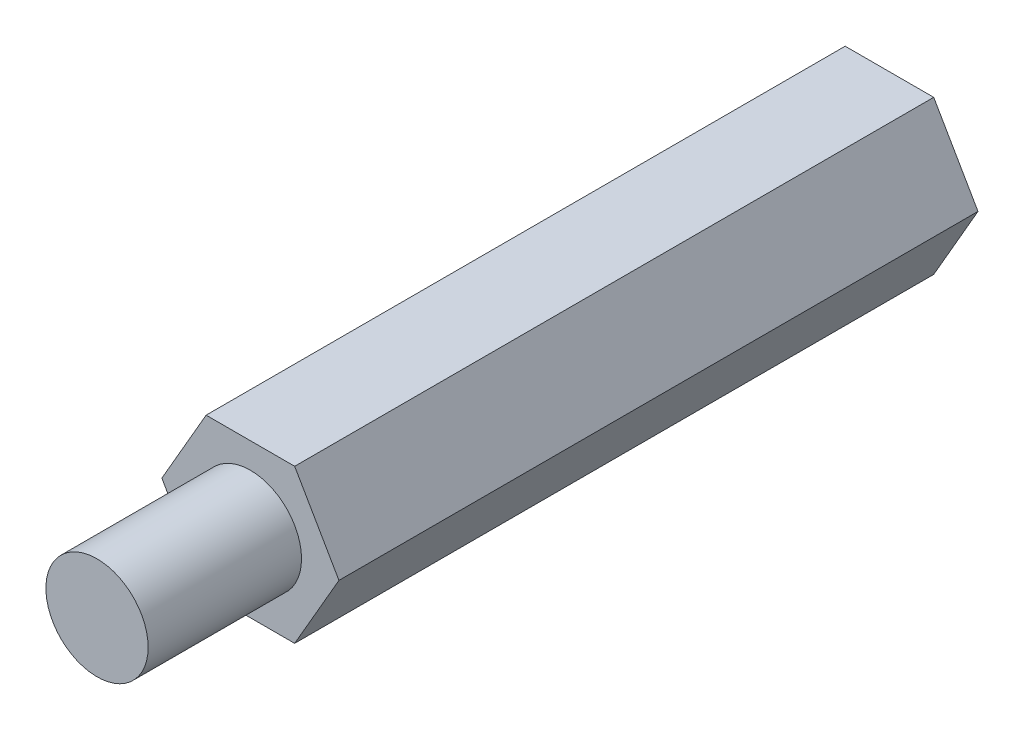
ISO-10303-21;
HEADER;
FILE_DESCRIPTION(('STEP AP214'),'2;1');
FILE_NAME('part.step','',(''),(''),'','','');
FILE_SCHEMA(('AUTOMOTIVE_DESIGN { 1 0 10303 214 1 1 1 1 }'));
ENDSEC;
DATA;
#1=APPLICATION_CONTEXT('core data for automotive mechanical design processes');
#2=APPLICATION_PROTOCOL_DEFINITION('international standard','automotive_design',2000,#1);
#3=PRODUCT_CONTEXT('',#1,'mechanical');
#4=PRODUCT('Part','Part','',(#3));
#5=PRODUCT_RELATED_PRODUCT_CATEGORY('part','',(#4));
#6=PRODUCT_DEFINITION_FORMATION('','',#4);
#7=PRODUCT_DEFINITION_CONTEXT('part definition',#1,'design');
#8=PRODUCT_DEFINITION('design','',#6,#7);
#9=PRODUCT_DEFINITION_SHAPE('','',#8);
#10=(LENGTH_UNIT() NAMED_UNIT(*) SI_UNIT(.MILLI.,.METRE.));
#11=(NAMED_UNIT(*) PLANE_ANGLE_UNIT() SI_UNIT($,.RADIAN.));
#12=(NAMED_UNIT(*) SI_UNIT($,.STERADIAN.) SOLID_ANGLE_UNIT());
#13=UNCERTAINTY_MEASURE_WITH_UNIT(LENGTH_MEASURE(1.E-05),#10,'distance_accuracy_value','');
#14=(GEOMETRIC_REPRESENTATION_CONTEXT(3) GLOBAL_UNCERTAINTY_ASSIGNED_CONTEXT((#13)) GLOBAL_UNIT_ASSIGNED_CONTEXT((#10,
#11,#12)) REPRESENTATION_CONTEXT('',''));
#15=CARTESIAN_POINT('',(0.,0.,0.));
#16=DIRECTION('',(0.,0.,1.));
#17=DIRECTION('',(1.,0.,0.));
#18=AXIS2_PLACEMENT_3D('',#15,#16,#17);
#19=CARTESIAN_POINT('',(1.73205080756888,-3.,25.));
#20=DIRECTION('',(-0.866025403784439,0.499999999999999,0.));
#21=DIRECTION('',(-0.5,-0.866025403784439,0.));
#22=AXIS2_PLACEMENT_3D('',#19,#20,#21);
#23=PLANE('',#22);
#24=DIRECTION('',(0.499999999999999,0.866025403784439,0.));
#25=VECTOR('',#24,1.);
#26=CARTESIAN_POINT('',(1.73205080756888,-3.,0.));
#27=LINE('',#26,#25);
#28=CARTESIAN_POINT('',(1.73205080756888,-3.,0.));
#29=VERTEX_POINT('',#28);
#30=CARTESIAN_POINT('',(3.46410161513775,0.,0.));
#31=VERTEX_POINT('',#30);
#32=EDGE_CURVE('E131',#29,#31,#27,.T.);
#33=ORIENTED_EDGE('',*,*,#32,.T.);
#34=DIRECTION('',(0.,0.,-1.));
#35=VECTOR('',#34,1.);
#36=CARTESIAN_POINT('',(3.46410161513775,0.,25.));
#37=LINE('',#36,#35);
#38=CARTESIAN_POINT('',(3.46410161513775,0.,25.));
#39=VERTEX_POINT('',#38);
#40=EDGE_CURVE('E46',#39,#31,#37,.T.);
#41=ORIENTED_EDGE('',*,*,#40,.F.);
#42=DIRECTION('',(0.499999999999999,0.866025403784439,0.));
#43=VECTOR('',#42,1.);
#44=CARTESIAN_POINT('',(1.73205080756888,-3.,25.));
#45=LINE('',#44,#43);
#46=CARTESIAN_POINT('',(1.73205080756888,-3.,25.));
#47=VERTEX_POINT('',#46);
#48=EDGE_CURVE('E142',#47,#39,#45,.T.);
#49=ORIENTED_EDGE('',*,*,#48,.F.);
#50=DIRECTION('',(0.,0.,-1.));
#51=VECTOR('',#50,1.);
#52=CARTESIAN_POINT('',(1.73205080756888,-3.,25.));
#53=LINE('',#52,#51);
#54=EDGE_CURVE('E127',#47,#29,#53,.T.);
#55=ORIENTED_EDGE('',*,*,#54,.T.);
#56=EDGE_LOOP('',(#33,#41,#49,#55));
#57=FACE_BOUND('',#56,.T.);
#58=ADVANCED_FACE('F43',(#57),#23,.F.);
#59=CARTESIAN_POINT('',(3.46410161513775,0.,25.));
#60=DIRECTION('',(-0.866025403784438,-0.5,0.));
#61=DIRECTION('',(0.5,-0.866025403784438,0.));
#62=AXIS2_PLACEMENT_3D('',#59,#60,#61);
#63=PLANE('',#62);
#64=DIRECTION('',(-0.5,0.866025403784438,0.));
#65=VECTOR('',#64,1.);
#66=CARTESIAN_POINT('',(3.46410161513775,0.,0.));
#67=LINE('',#66,#65);
#68=CARTESIAN_POINT('',(1.73205080756888,3.,0.));
#69=VERTEX_POINT('',#68);
#70=EDGE_CURVE('E134',#31,#69,#67,.T.);
#71=ORIENTED_EDGE('',*,*,#70,.T.);
#72=DIRECTION('',(0.,0.,-1.));
#73=VECTOR('',#72,1.);
#74=CARTESIAN_POINT('',(1.73205080756888,3.,25.));
#75=LINE('',#74,#73);
#76=CARTESIAN_POINT('',(1.73205080756888,3.,25.));
#77=VERTEX_POINT('',#76);
#78=EDGE_CURVE('E145',#77,#69,#75,.T.);
#79=ORIENTED_EDGE('',*,*,#78,.F.);
#80=DIRECTION('',(-0.5,0.866025403784438,0.));
#81=VECTOR('',#80,1.);
#82=CARTESIAN_POINT('',(3.46410161513775,0.,25.));
#83=LINE('',#82,#81);
#84=EDGE_CURVE('E99',#39,#77,#83,.T.);
#85=ORIENTED_EDGE('',*,*,#84,.F.);
#86=ORIENTED_EDGE('',*,*,#40,.T.);
#87=EDGE_LOOP('',(#71,#79,#85,#86));
#88=FACE_BOUND('',#87,.T.);
#89=ADVANCED_FACE('F150',(#88),#63,.F.);
#90=CARTESIAN_POINT('',(1.73205080756888,3.,25.));
#91=DIRECTION('',(0.,-1.,0.));
#92=DIRECTION('',(1.,0.,0.));
#93=AXIS2_PLACEMENT_3D('',#90,#91,#92);
#94=PLANE('',#93);
#95=DIRECTION('',(-1.,0.,0.));
#96=VECTOR('',#95,1.);
#97=CARTESIAN_POINT('',(1.73205080756888,3.,0.));
#98=LINE('',#97,#96);
#99=CARTESIAN_POINT('',(-1.73205080756888,3.,0.));
#100=VERTEX_POINT('',#99);
#101=EDGE_CURVE('E137',#69,#100,#98,.T.);
#102=ORIENTED_EDGE('',*,*,#101,.T.);
#103=DIRECTION('',(0.,0.,-1.));
#104=VECTOR('',#103,1.);
#105=CARTESIAN_POINT('',(-1.73205080756888,3.,25.));
#106=LINE('',#105,#104);
#107=CARTESIAN_POINT('',(-1.73205080756888,3.,25.));
#108=VERTEX_POINT('',#107);
#109=EDGE_CURVE('E122',#108,#100,#106,.T.);
#110=ORIENTED_EDGE('',*,*,#109,.F.);
#111=DIRECTION('',(-1.,0.,0.));
#112=VECTOR('',#111,1.);
#113=CARTESIAN_POINT('',(1.73205080756888,3.,25.));
#114=LINE('',#113,#112);
#115=EDGE_CURVE('E113',#77,#108,#114,.T.);
#116=ORIENTED_EDGE('',*,*,#115,.F.);
#117=ORIENTED_EDGE('',*,*,#78,.T.);
#118=EDGE_LOOP('',(#102,#110,#116,#117));
#119=FACE_BOUND('',#118,.T.);
#120=ADVANCED_FACE('F156',(#119),#94,.F.);
#121=CARTESIAN_POINT('',(-1.73205080756888,3.,25.));
#122=DIRECTION('',(0.866025403784439,-0.5,0.));
#123=DIRECTION('',(0.5,0.866025403784439,0.));
#124=AXIS2_PLACEMENT_3D('',#121,#122,#123);
#125=PLANE('',#124);
#126=DIRECTION('',(-0.5,-0.866025403784439,0.));
#127=VECTOR('',#126,1.);
#128=CARTESIAN_POINT('',(-1.73205080756888,3.,0.));
#129=LINE('',#128,#127);
#130=CARTESIAN_POINT('',(-3.46410161513775,0.,0.));
#131=VERTEX_POINT('',#130);
#132=EDGE_CURVE('E121',#100,#131,#129,.T.);
#133=ORIENTED_EDGE('',*,*,#132,.T.);
#134=DIRECTION('',(0.,0.,-1.));
#135=VECTOR('',#134,1.);
#136=CARTESIAN_POINT('',(-3.46410161513775,0.,25.));
#137=LINE('',#136,#135);
#138=CARTESIAN_POINT('',(-3.46410161513775,0.,25.));
#139=VERTEX_POINT('',#138);
#140=EDGE_CURVE('E118',#139,#131,#137,.T.);
#141=ORIENTED_EDGE('',*,*,#140,.F.);
#142=DIRECTION('',(-0.5,-0.866025403784439,0.));
#143=VECTOR('',#142,1.);
#144=CARTESIAN_POINT('',(-1.73205080756888,3.,25.));
#145=LINE('',#144,#143);
#146=EDGE_CURVE('E107',#108,#139,#145,.T.);
#147=ORIENTED_EDGE('',*,*,#146,.F.);
#148=ORIENTED_EDGE('',*,*,#109,.T.);
#149=EDGE_LOOP('',(#133,#141,#147,#148));
#150=FACE_BOUND('',#149,.T.);
#151=ADVANCED_FACE('F119',(#150),#125,.F.);
#152=CARTESIAN_POINT('',(-3.46410161513775,0.,25.));
#153=DIRECTION('',(0.866025403784438,0.500000000000001,0.));
#154=DIRECTION('',(-0.500000000000001,0.866025403784438,0.));
#155=AXIS2_PLACEMENT_3D('',#152,#153,#154);
#156=PLANE('',#155);
#157=DIRECTION('',(0.500000000000001,-0.866025403784438,0.));
#158=VECTOR('',#157,1.);
#159=CARTESIAN_POINT('',(-3.46410161513775,0.,0.));
#160=LINE('',#159,#158);
#161=CARTESIAN_POINT('',(-1.73205080756887,-3.,0.));
#162=VERTEX_POINT('',#161);
#163=EDGE_CURVE('E84',#131,#162,#160,.T.);
#164=ORIENTED_EDGE('',*,*,#163,.T.);
#165=DIRECTION('',(0.,0.,-1.));
#166=VECTOR('',#165,1.);
#167=CARTESIAN_POINT('',(-1.73205080756887,-3.,25.));
#168=LINE('',#167,#166);
#169=CARTESIAN_POINT('',(-1.73205080756887,-3.,25.));
#170=VERTEX_POINT('',#169);
#171=EDGE_CURVE('E123',#170,#162,#168,.T.);
#172=ORIENTED_EDGE('',*,*,#171,.F.);
#173=DIRECTION('',(0.500000000000001,-0.866025403784438,0.));
#174=VECTOR('',#173,1.);
#175=CARTESIAN_POINT('',(-3.46410161513775,0.,25.));
#176=LINE('',#175,#174);
#177=EDGE_CURVE('E111',#139,#170,#176,.T.);
#178=ORIENTED_EDGE('',*,*,#177,.F.);
#179=ORIENTED_EDGE('',*,*,#140,.T.);
#180=EDGE_LOOP('',(#164,#172,#178,#179));
#181=FACE_BOUND('',#180,.T.);
#182=ADVANCED_FACE('F125',(#181),#156,.F.);
#183=CARTESIAN_POINT('',(-1.73205080756887,-3.,25.));
#184=DIRECTION('',(0.,1.,0.));
#185=DIRECTION('',(-1.,0.,0.));
#186=AXIS2_PLACEMENT_3D('',#183,#184,#185);
#187=PLANE('',#186);
#188=DIRECTION('',(1.,0.,0.));
#189=VECTOR('',#188,1.);
#190=CARTESIAN_POINT('',(-1.73205080756887,-3.,0.));
#191=LINE('',#190,#189);
#192=EDGE_CURVE('E90',#162,#29,#191,.T.);
#193=ORIENTED_EDGE('',*,*,#192,.T.);
#194=ORIENTED_EDGE('',*,*,#54,.F.);
#195=DIRECTION('',(1.,0.,0.));
#196=VECTOR('',#195,1.);
#197=CARTESIAN_POINT('',(-1.73205080756887,-3.,25.));
#198=LINE('',#197,#196);
#199=EDGE_CURVE('E60',#170,#47,#198,.T.);
#200=ORIENTED_EDGE('',*,*,#199,.F.);
#201=ORIENTED_EDGE('',*,*,#171,.T.);
#202=EDGE_LOOP('',(#193,#194,#200,#201));
#203=FACE_BOUND('',#202,.T.);
#204=ADVANCED_FACE('F183',(#203),#187,.F.);
#205=CARTESIAN_POINT('',(0.,0.,25.));
#206=DIRECTION('',(0.,0.,1.));
#207=DIRECTION('',(1.,0.,0.));
#208=AXIS2_PLACEMENT_3D('',#205,#206,#207);
#209=PLANE('',#208);
#210=CARTESIAN_POINT('',(0.,0.,25.));
#211=DIRECTION('',(0.,0.,1.));
#212=DIRECTION('',(1.,0.,0.));
#213=AXIS2_PLACEMENT_3D('',#210,#211,#212);
#214=CIRCLE('',#213,2.);
#215=CARTESIAN_POINT('',(2.,0.,25.));
#216=VERTEX_POINT('',#215);
#217=EDGE_CURVE('E11',#216,#216,#214,.T.);
#218=ORIENTED_EDGE('',*,*,#217,.F.);
#219=EDGE_LOOP('',(#218));
#220=FACE_BOUND('',#219,.T.);
#221=ORIENTED_EDGE('',*,*,#48,.T.);
#222=ORIENTED_EDGE('',*,*,#84,.T.);
#223=ORIENTED_EDGE('',*,*,#115,.T.);
#224=ORIENTED_EDGE('',*,*,#146,.T.);
#225=ORIENTED_EDGE('',*,*,#177,.T.);
#226=ORIENTED_EDGE('',*,*,#199,.T.);
#227=EDGE_LOOP('',(#221,#222,#223,#224,#225,#226));
#228=FACE_BOUND('',#227,.T.);
#229=ADVANCED_FACE('F109',(#220,#228),#209,.T.);
#230=CARTESIAN_POINT('',(0.,0.,0.));
#231=DIRECTION('',(0.,0.,1.));
#232=DIRECTION('',(1.,0.,0.));
#233=AXIS2_PLACEMENT_3D('',#230,#231,#232);
#234=PLANE('',#233);
#235=CARTESIAN_POINT('',(0.,0.,0.));
#236=DIRECTION('',(0.,0.,-1.));
#237=DIRECTION('',(-1.,0.,0.));
#238=AXIS2_PLACEMENT_3D('',#235,#236,#237);
#239=CIRCLE('',#238,1.64999999999999);
#240=CARTESIAN_POINT('',(-1.64999999999999,0.,0.));
#241=VERTEX_POINT('',#240);
#242=EDGE_CURVE('E165',#241,#241,#239,.T.);
#243=ORIENTED_EDGE('',*,*,#242,.F.);
#244=EDGE_LOOP('',(#243));
#245=FACE_BOUND('',#244,.T.);
#246=ORIENTED_EDGE('',*,*,#32,.F.);
#247=ORIENTED_EDGE('',*,*,#192,.F.);
#248=ORIENTED_EDGE('',*,*,#163,.F.);
#249=ORIENTED_EDGE('',*,*,#132,.F.);
#250=ORIENTED_EDGE('',*,*,#101,.F.);
#251=ORIENTED_EDGE('',*,*,#70,.F.);
#252=EDGE_LOOP('',(#246,#247,#248,#249,#250,#251));
#253=FACE_BOUND('',#252,.T.);
#254=ADVANCED_FACE('F155',(#245,#253),#234,.F.);
#255=CARTESIAN_POINT('',(0.,0.,31.));
#256=DIRECTION('',(0.,0.,-1.));
#257=DIRECTION('',(-1.,0.,0.));
#258=AXIS2_PLACEMENT_3D('',#255,#256,#257);
#259=CYLINDRICAL_SURFACE('',#258,2.);
#260=CARTESIAN_POINT('',(0.,0.,31.));
#261=DIRECTION('',(0.,0.,1.));
#262=DIRECTION('',(1.,0.,0.));
#263=AXIS2_PLACEMENT_3D('',#260,#261,#262);
#264=CIRCLE('',#263,2.);
#265=CARTESIAN_POINT('',(2.,0.,31.));
#266=VERTEX_POINT('',#265);
#267=EDGE_CURVE('E135',#266,#266,#264,.T.);
#268=ORIENTED_EDGE('',*,*,#267,.F.);
#269=EDGE_LOOP('',(#268));
#270=FACE_BOUND('',#269,.T.);
#271=ORIENTED_EDGE('',*,*,#217,.T.);
#272=EDGE_LOOP('',(#271));
#273=FACE_BOUND('',#272,.T.);
#274=ADVANCED_FACE('F172',(#270,#273),#259,.T.);
#275=CARTESIAN_POINT('',(0.,0.,31.));
#276=DIRECTION('',(0.,0.,1.));
#277=DIRECTION('',(1.,0.,0.));
#278=AXIS2_PLACEMENT_3D('',#275,#276,#277);
#279=PLANE('',#278);
#280=ORIENTED_EDGE('',*,*,#267,.T.);
#281=EDGE_LOOP('',(#280));
#282=FACE_BOUND('',#281,.T.);
#283=ADVANCED_FACE('F179',(#282),#279,.T.);
#284=CARTESIAN_POINT('',(0.,0.,10.1));
#285=DIRECTION('',(0.,0.,-1.));
#286=DIRECTION('',(-1.,0.,0.));
#287=AXIS2_PLACEMENT_3D('',#284,#285,#286);
#288=CONICAL_SURFACE('',#287,1.65,1.02974425867665);
#289=CARTESIAN_POINT('',(0.,0.,11.0914200213955));
#290=VERTEX_POINT('',#289);
#291=VERTEX_LOOP('',#290);
#292=FACE_BOUND('',#291,.T.);
#293=CARTESIAN_POINT('',(0.,0.,10.1));
#294=DIRECTION('',(0.,0.,-1.));
#295=DIRECTION('',(-1.,0.,0.));
#296=AXIS2_PLACEMENT_3D('',#293,#294,#295);
#297=CIRCLE('',#296,1.65);
#298=CARTESIAN_POINT('',(-1.65,0.,10.1));
#299=VERTEX_POINT('',#298);
#300=EDGE_CURVE('E162',#299,#299,#297,.T.);
#301=ORIENTED_EDGE('',*,*,#300,.T.);
#302=EDGE_LOOP('',(#301));
#303=FACE_BOUND('',#302,.T.);
#304=ADVANCED_FACE('F219',(#292,#303),#288,.F.);
#305=CARTESIAN_POINT('',(0.,0.,0.));
#306=DIRECTION('',(0.,0.,-1.));
#307=DIRECTION('',(-1.,0.,0.));
#308=AXIS2_PLACEMENT_3D('',#305,#306,#307);
#309=CYLINDRICAL_SURFACE('',#308,1.64999999999999);
#310=ORIENTED_EDGE('',*,*,#300,.F.);
#311=EDGE_LOOP('',(#310));
#312=FACE_BOUND('',#311,.T.);
#313=ORIENTED_EDGE('',*,*,#242,.T.);
#314=EDGE_LOOP('',(#313));
#315=FACE_BOUND('',#314,.T.);
#316=ADVANCED_FACE('F169',(#312,#315),#309,.F.);
#317=CLOSED_SHELL('',(#58,#89,#120,#151,#182,#204,#229,#254,#274,#283,#304,#316));
#318=MANIFOLD_SOLID_BREP('B2',#317);
#319=ADVANCED_BREP_SHAPE_REPRESENTATION('',(#18,#318),#14);
#320=SHAPE_DEFINITION_REPRESENTATION(#9,#319);
ENDSEC;
END-ISO-10303-21;
